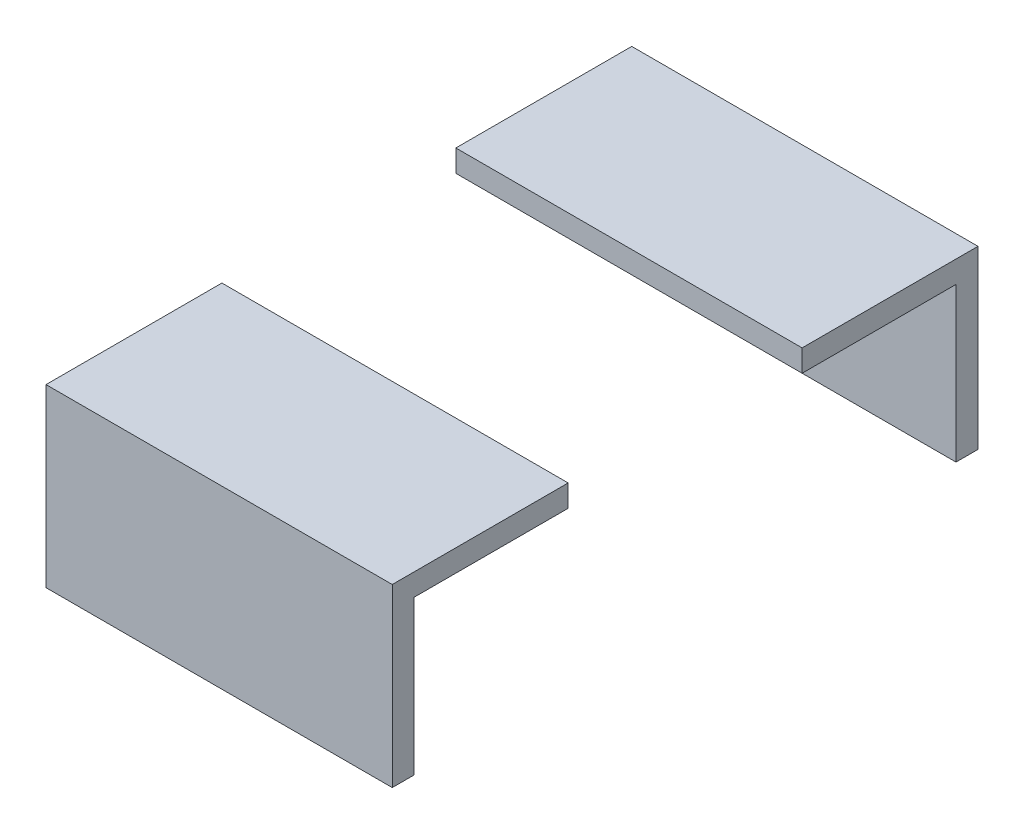
ISO-10303-21;
HEADER;
FILE_DESCRIPTION(('STEP AP214'),'2;1');
FILE_NAME('part.step','',(''),(''),'','','');
FILE_SCHEMA(('AUTOMOTIVE_DESIGN { 1 0 10303 214 1 1 1 1 }'));
ENDSEC;
DATA;
#1=APPLICATION_CONTEXT('core data for automotive mechanical design processes');
#2=APPLICATION_PROTOCOL_DEFINITION('international standard','automotive_design',2000,#1);
#3=PRODUCT_CONTEXT('',#1,'mechanical');
#4=PRODUCT('Part','Part','',(#3));
#5=PRODUCT_RELATED_PRODUCT_CATEGORY('part','',(#4));
#6=PRODUCT_DEFINITION_FORMATION('','',#4);
#7=PRODUCT_DEFINITION_CONTEXT('part definition',#1,'design');
#8=PRODUCT_DEFINITION('design','',#6,#7);
#9=PRODUCT_DEFINITION_SHAPE('','',#8);
#10=(LENGTH_UNIT() NAMED_UNIT(*) SI_UNIT(.MILLI.,.METRE.));
#11=(NAMED_UNIT(*) PLANE_ANGLE_UNIT() SI_UNIT($,.RADIAN.));
#12=(NAMED_UNIT(*) SI_UNIT($,.STERADIAN.) SOLID_ANGLE_UNIT());
#13=UNCERTAINTY_MEASURE_WITH_UNIT(LENGTH_MEASURE(1.E-05),#10,'distance_accuracy_value','');
#14=(GEOMETRIC_REPRESENTATION_CONTEXT(3) GLOBAL_UNCERTAINTY_ASSIGNED_CONTEXT((#13)) GLOBAL_UNIT_ASSIGNED_CONTEXT((#10,
#11,#12)) REPRESENTATION_CONTEXT('',''));
#15=CARTESIAN_POINT('',(0.,0.,0.));
#16=DIRECTION('',(0.,0.,1.));
#17=DIRECTION('',(1.,0.,0.));
#18=AXIS2_PLACEMENT_3D('',#15,#16,#17);
#19=CARTESIAN_POINT('',(12.5,5.3375,8.4455));
#20=DIRECTION('',(0.,-1.,0.));
#21=DIRECTION('',(0.,0.,-1.));
#22=AXIS2_PLACEMENT_3D('',#19,#20,#21);
#23=PLANE('',#22);
#24=DIRECTION('',(0.,0.,1.));
#25=VECTOR('',#24,1.);
#26=CARTESIAN_POINT('',(-12.5,5.3375,8.4455));
#27=LINE('',#26,#25);
#28=CARTESIAN_POINT('',(-12.5,5.3375,8.4455));
#29=VERTEX_POINT('',#28);
#30=CARTESIAN_POINT('',(-12.5,5.33749999999999,21.1455));
#31=VERTEX_POINT('',#30);
#32=EDGE_CURVE('E136',#29,#31,#27,.T.);
#33=ORIENTED_EDGE('',*,*,#32,.T.);
#34=DIRECTION('',(-1.,0.,0.));
#35=VECTOR('',#34,1.);
#36=CARTESIAN_POINT('',(12.5,5.33749999999999,21.1455));
#37=LINE('',#36,#35);
#38=CARTESIAN_POINT('',(12.5,5.33749999999999,21.1455));
#39=VERTEX_POINT('',#38);
#40=EDGE_CURVE('E12',#39,#31,#37,.T.);
#41=ORIENTED_EDGE('',*,*,#40,.F.);
#42=DIRECTION('',(0.,0.,1.));
#43=VECTOR('',#42,1.);
#44=CARTESIAN_POINT('',(12.5,5.3375,8.4455));
#45=LINE('',#44,#43);
#46=CARTESIAN_POINT('',(12.5,5.3375,8.4455));
#47=VERTEX_POINT('',#46);
#48=EDGE_CURVE('E146',#47,#39,#45,.T.);
#49=ORIENTED_EDGE('',*,*,#48,.F.);
#50=DIRECTION('',(-1.,0.,0.));
#51=VECTOR('',#50,1.);
#52=CARTESIAN_POINT('',(12.5,5.3375,8.4455));
#53=LINE('',#52,#51);
#54=EDGE_CURVE('E132',#47,#29,#53,.T.);
#55=ORIENTED_EDGE('',*,*,#54,.T.);
#56=EDGE_LOOP('',(#33,#41,#49,#55));
#57=FACE_BOUND('',#56,.T.);
#58=ADVANCED_FACE('F52',(#57),#23,.F.);
#59=CARTESIAN_POINT('',(12.5,5.33749999999999,21.1455));
#60=DIRECTION('',(0.,0.,-1.));
#61=DIRECTION('',(-1.,0.,0.));
#62=AXIS2_PLACEMENT_3D('',#59,#60,#61);
#63=PLANE('',#62);
#64=DIRECTION('',(0.,-1.,0.));
#65=VECTOR('',#64,1.);
#66=CARTESIAN_POINT('',(-12.5,5.33749999999999,21.1455));
#67=LINE('',#66,#65);
#68=CARTESIAN_POINT('',(-12.5,-7.36249999999998,21.1455));
#69=VERTEX_POINT('',#68);
#70=EDGE_CURVE('E139',#31,#69,#67,.T.);
#71=ORIENTED_EDGE('',*,*,#70,.T.);
#72=DIRECTION('',(-1.,0.,0.));
#73=VECTOR('',#72,1.);
#74=CARTESIAN_POINT('',(12.5,-7.36249999999998,21.1455));
#75=LINE('',#74,#73);
#76=CARTESIAN_POINT('',(12.5,-7.36249999999998,21.1455));
#77=VERTEX_POINT('',#76);
#78=EDGE_CURVE('E60',#77,#69,#75,.T.);
#79=ORIENTED_EDGE('',*,*,#78,.F.);
#80=DIRECTION('',(0.,-1.,0.));
#81=VECTOR('',#80,1.);
#82=CARTESIAN_POINT('',(12.5,5.33749999999999,21.1455));
#83=LINE('',#82,#81);
#84=EDGE_CURVE('E105',#39,#77,#83,.T.);
#85=ORIENTED_EDGE('',*,*,#84,.F.);
#86=ORIENTED_EDGE('',*,*,#40,.T.);
#87=EDGE_LOOP('',(#71,#79,#85,#86));
#88=FACE_BOUND('',#87,.T.);
#89=ADVANCED_FACE('F170',(#88),#63,.F.);
#90=CARTESIAN_POINT('',(12.5,-7.36249999999996,19.558));
#91=DIRECTION('',(0.,1.,0.));
#92=DIRECTION('',(0.,0.,1.));
#93=AXIS2_PLACEMENT_3D('',#90,#91,#92);
#94=PLANE('',#93);
#95=DIRECTION('',(0.,0.,-1.));
#96=VECTOR('',#95,1.);
#97=CARTESIAN_POINT('',(-12.5,-7.36249999999996,19.558));
#98=LINE('',#97,#96);
#99=CARTESIAN_POINT('',(-12.5,-7.36249999999996,19.558));
#100=VERTEX_POINT('',#99);
#101=EDGE_CURVE('E141',#69,#100,#98,.T.);
#102=ORIENTED_EDGE('',*,*,#101,.T.);
#103=DIRECTION('',(-1.,0.,0.));
#104=VECTOR('',#103,1.);
#105=CARTESIAN_POINT('',(12.5,-7.36249999999996,19.558));
#106=LINE('',#105,#104);
#107=CARTESIAN_POINT('',(12.5,-7.36249999999996,19.558));
#108=VERTEX_POINT('',#107);
#109=EDGE_CURVE('E127',#108,#100,#106,.T.);
#110=ORIENTED_EDGE('',*,*,#109,.F.);
#111=DIRECTION('',(0.,0.,-1.));
#112=VECTOR('',#111,1.);
#113=CARTESIAN_POINT('',(12.5,-7.36249999999996,19.558));
#114=LINE('',#113,#112);
#115=EDGE_CURVE('E118',#77,#108,#114,.T.);
#116=ORIENTED_EDGE('',*,*,#115,.F.);
#117=ORIENTED_EDGE('',*,*,#78,.T.);
#118=EDGE_LOOP('',(#102,#110,#116,#117));
#119=FACE_BOUND('',#118,.T.);
#120=ADVANCED_FACE('F152',(#119),#94,.F.);
#121=CARTESIAN_POINT('',(12.5,3.75,19.558));
#122=DIRECTION('',(0.,0.,1.));
#123=DIRECTION('',(1.,0.,0.));
#124=AXIS2_PLACEMENT_3D('',#121,#122,#123);
#125=PLANE('',#124);
#126=DIRECTION('',(0.,1.,0.));
#127=VECTOR('',#126,1.);
#128=CARTESIAN_POINT('',(-12.5,3.75,19.558));
#129=LINE('',#128,#127);
#130=CARTESIAN_POINT('',(-12.5,3.75,19.558));
#131=VERTEX_POINT('',#130);
#132=EDGE_CURVE('E126',#100,#131,#129,.T.);
#133=ORIENTED_EDGE('',*,*,#132,.T.);
#134=DIRECTION('',(-1.,0.,0.));
#135=VECTOR('',#134,1.);
#136=CARTESIAN_POINT('',(12.5,3.75,19.558));
#137=LINE('',#136,#135);
#138=CARTESIAN_POINT('',(12.5,3.75,19.558));
#139=VERTEX_POINT('',#138);
#140=EDGE_CURVE('E123',#139,#131,#137,.T.);
#141=ORIENTED_EDGE('',*,*,#140,.F.);
#142=DIRECTION('',(0.,1.,0.));
#143=VECTOR('',#142,1.);
#144=CARTESIAN_POINT('',(12.5,3.75,19.558));
#145=LINE('',#144,#143);
#146=EDGE_CURVE('E112',#108,#139,#145,.T.);
#147=ORIENTED_EDGE('',*,*,#146,.F.);
#148=ORIENTED_EDGE('',*,*,#109,.T.);
#149=EDGE_LOOP('',(#133,#141,#147,#148));
#150=FACE_BOUND('',#149,.T.);
#151=ADVANCED_FACE('F124',(#150),#125,.F.);
#152=CARTESIAN_POINT('',(12.5,3.75,8.4455));
#153=DIRECTION('',(0.,1.,0.));
#154=DIRECTION('',(0.,0.,1.));
#155=AXIS2_PLACEMENT_3D('',#152,#153,#154);
#156=PLANE('',#155);
#157=DIRECTION('',(0.,0.,-1.));
#158=VECTOR('',#157,1.);
#159=CARTESIAN_POINT('',(-12.5,3.75,8.4455));
#160=LINE('',#159,#158);
#161=CARTESIAN_POINT('',(-12.5,3.75,8.4455));
#162=VERTEX_POINT('',#161);
#163=EDGE_CURVE('E91',#131,#162,#160,.T.);
#164=ORIENTED_EDGE('',*,*,#163,.T.);
#165=DIRECTION('',(-1.,0.,0.));
#166=VECTOR('',#165,1.);
#167=CARTESIAN_POINT('',(12.5,3.75,8.4455));
#168=LINE('',#167,#166);
#169=CARTESIAN_POINT('',(12.5,3.75,8.4455));
#170=VERTEX_POINT('',#169);
#171=EDGE_CURVE('E128',#170,#162,#168,.T.);
#172=ORIENTED_EDGE('',*,*,#171,.F.);
#173=DIRECTION('',(0.,0.,-1.));
#174=VECTOR('',#173,1.);
#175=CARTESIAN_POINT('',(12.5,3.75,8.4455));
#176=LINE('',#175,#174);
#177=EDGE_CURVE('E116',#139,#170,#176,.T.);
#178=ORIENTED_EDGE('',*,*,#177,.F.);
#179=ORIENTED_EDGE('',*,*,#140,.T.);
#180=EDGE_LOOP('',(#164,#172,#178,#179));
#181=FACE_BOUND('',#180,.T.);
#182=ADVANCED_FACE('F130',(#181),#156,.F.);
#183=CARTESIAN_POINT('',(12.5,3.75,8.4455));
#184=DIRECTION('',(0.,0.,1.));
#185=DIRECTION('',(0.,-1.,0.));
#186=AXIS2_PLACEMENT_3D('',#183,#184,#185);
#187=PLANE('',#186);
#188=DIRECTION('',(0.,1.,0.));
#189=VECTOR('',#188,1.);
#190=CARTESIAN_POINT('',(-12.5,3.75,8.4455));
#191=LINE('',#190,#189);
#192=EDGE_CURVE('E97',#162,#29,#191,.T.);
#193=ORIENTED_EDGE('',*,*,#192,.T.);
#194=ORIENTED_EDGE('',*,*,#54,.F.);
#195=DIRECTION('',(0.,1.,0.));
#196=VECTOR('',#195,1.);
#197=CARTESIAN_POINT('',(12.5,3.75,8.4455));
#198=LINE('',#197,#196);
#199=EDGE_CURVE('E68',#170,#47,#198,.T.);
#200=ORIENTED_EDGE('',*,*,#199,.F.);
#201=ORIENTED_EDGE('',*,*,#171,.T.);
#202=EDGE_LOOP('',(#193,#194,#200,#201));
#203=FACE_BOUND('',#202,.T.);
#204=ADVANCED_FACE('F159',(#203),#187,.F.);
#205=CARTESIAN_POINT('',(12.5,0.,0.));
#206=DIRECTION('',(1.,0.,0.));
#207=DIRECTION('',(0.,0.,-1.));
#208=AXIS2_PLACEMENT_3D('',#205,#206,#207);
#209=PLANE('',#208);
#210=ORIENTED_EDGE('',*,*,#48,.T.);
#211=ORIENTED_EDGE('',*,*,#84,.T.);
#212=ORIENTED_EDGE('',*,*,#115,.T.);
#213=ORIENTED_EDGE('',*,*,#146,.T.);
#214=ORIENTED_EDGE('',*,*,#177,.T.);
#215=ORIENTED_EDGE('',*,*,#199,.T.);
#216=EDGE_LOOP('',(#210,#211,#212,#213,#214,#215));
#217=FACE_BOUND('',#216,.T.);
#218=ADVANCED_FACE('F114',(#217),#209,.T.);
#219=CARTESIAN_POINT('',(-12.5,0.,0.));
#220=DIRECTION('',(1.,0.,0.));
#221=DIRECTION('',(0.,0.,-1.));
#222=AXIS2_PLACEMENT_3D('',#219,#220,#221);
#223=PLANE('',#222);
#224=ORIENTED_EDGE('',*,*,#32,.F.);
#225=ORIENTED_EDGE('',*,*,#192,.F.);
#226=ORIENTED_EDGE('',*,*,#163,.F.);
#227=ORIENTED_EDGE('',*,*,#132,.F.);
#228=ORIENTED_EDGE('',*,*,#101,.F.);
#229=ORIENTED_EDGE('',*,*,#70,.F.);
#230=EDGE_LOOP('',(#224,#225,#226,#227,#228,#229));
#231=FACE_BOUND('',#230,.T.);
#232=ADVANCED_FACE('F155',(#231),#223,.F.);
#233=CLOSED_SHELL('',(#58,#89,#120,#151,#182,#204,#218,#232));
#234=MANIFOLD_SOLID_BREP('B2',#233);
#235=CARTESIAN_POINT('',(12.5,3.75,-8.4455));
#236=DIRECTION('',(0.,0.,-1.));
#237=DIRECTION('',(0.,1.,0.));
#238=AXIS2_PLACEMENT_3D('',#235,#236,#237);
#239=PLANE('',#238);
#240=DIRECTION('',(0.,-1.,0.));
#241=VECTOR('',#240,1.);
#242=CARTESIAN_POINT('',(-12.5,3.75,-8.4455));
#243=LINE('',#242,#241);
#244=CARTESIAN_POINT('',(-12.5,5.3375,-8.4455));
#245=VERTEX_POINT('',#244);
#246=CARTESIAN_POINT('',(-12.5,3.75,-8.4455));
#247=VERTEX_POINT('',#246);
#248=EDGE_CURVE('E330',#245,#247,#243,.T.);
#249=ORIENTED_EDGE('',*,*,#248,.T.);
#250=DIRECTION('',(-1.,0.,0.));
#251=VECTOR('',#250,1.);
#252=CARTESIAN_POINT('',(12.5,3.75,-8.4455));
#253=LINE('',#252,#251);
#254=CARTESIAN_POINT('',(12.5,3.75,-8.4455));
#255=VERTEX_POINT('',#254);
#256=EDGE_CURVE('E50',#255,#247,#253,.T.);
#257=ORIENTED_EDGE('',*,*,#256,.F.);
#258=DIRECTION('',(0.,-1.,0.));
#259=VECTOR('',#258,1.);
#260=CARTESIAN_POINT('',(12.5,3.75,-8.4455));
#261=LINE('',#260,#259);
#262=CARTESIAN_POINT('',(12.5,5.3375,-8.4455));
#263=VERTEX_POINT('',#262);
#264=EDGE_CURVE('E346',#263,#255,#261,.T.);
#265=ORIENTED_EDGE('',*,*,#264,.F.);
#266=DIRECTION('',(-1.,0.,0.));
#267=VECTOR('',#266,1.);
#268=CARTESIAN_POINT('',(12.5,5.3375,-8.4455));
#269=LINE('',#268,#267);
#270=EDGE_CURVE('E326',#263,#245,#269,.T.);
#271=ORIENTED_EDGE('',*,*,#270,.T.);
#272=EDGE_LOOP('',(#249,#257,#265,#271));
#273=FACE_BOUND('',#272,.T.);
#274=ADVANCED_FACE('F227',(#273),#239,.F.);
#275=CARTESIAN_POINT('',(12.5,3.75,-8.4455));
#276=DIRECTION('',(0.,1.,0.));
#277=DIRECTION('',(0.,0.,1.));
#278=AXIS2_PLACEMENT_3D('',#275,#276,#277);
#279=PLANE('',#278);
#280=DIRECTION('',(0.,0.,-1.));
#281=VECTOR('',#280,1.);
#282=CARTESIAN_POINT('',(-12.5,3.75,-8.4455));
#283=LINE('',#282,#281);
#284=CARTESIAN_POINT('',(-12.5,3.75,-19.558));
#285=VERTEX_POINT('',#284);
#286=EDGE_CURVE('E334',#247,#285,#283,.T.);
#287=ORIENTED_EDGE('',*,*,#286,.T.);
#288=DIRECTION('',(-1.,0.,0.));
#289=VECTOR('',#288,1.);
#290=CARTESIAN_POINT('',(12.5,3.75,-19.558));
#291=LINE('',#290,#289);
#292=CARTESIAN_POINT('',(12.5,3.75,-19.558));
#293=VERTEX_POINT('',#292);
#294=EDGE_CURVE('E236',#293,#285,#291,.T.);
#295=ORIENTED_EDGE('',*,*,#294,.F.);
#296=DIRECTION('',(0.,0.,-1.));
#297=VECTOR('',#296,1.);
#298=CARTESIAN_POINT('',(12.5,3.75,-8.4455));
#299=LINE('',#298,#297);
#300=EDGE_CURVE('E292',#255,#293,#299,.T.);
#301=ORIENTED_EDGE('',*,*,#300,.F.);
#302=ORIENTED_EDGE('',*,*,#256,.T.);
#303=EDGE_LOOP('',(#287,#295,#301,#302));
#304=FACE_BOUND('',#303,.T.);
#305=ADVANCED_FACE('F373',(#304),#279,.F.);
#306=CARTESIAN_POINT('',(12.5,3.75,-19.558));
#307=DIRECTION('',(0.,0.,-1.));
#308=DIRECTION('',(-1.,0.,0.));
#309=AXIS2_PLACEMENT_3D('',#306,#307,#308);
#310=PLANE('',#309);
#311=DIRECTION('',(0.,-1.,0.));
#312=VECTOR('',#311,1.);
#313=CARTESIAN_POINT('',(-12.5,3.75,-19.558));
#314=LINE('',#313,#312);
#315=CARTESIAN_POINT('',(-12.5,-7.36249999999995,-19.558));
#316=VERTEX_POINT('',#315);
#317=EDGE_CURVE('E337',#285,#316,#314,.T.);
#318=ORIENTED_EDGE('',*,*,#317,.T.);
#319=DIRECTION('',(-1.,0.,0.));
#320=VECTOR('',#319,1.);
#321=CARTESIAN_POINT('',(12.5,-7.36249999999995,-19.558));
#322=LINE('',#321,#320);
#323=CARTESIAN_POINT('',(12.5,-7.36249999999995,-19.558));
#324=VERTEX_POINT('',#323);
#325=EDGE_CURVE('E317',#324,#316,#322,.T.);
#326=ORIENTED_EDGE('',*,*,#325,.F.);
#327=DIRECTION('',(0.,-1.,0.));
#328=VECTOR('',#327,1.);
#329=CARTESIAN_POINT('',(12.5,3.75,-19.558));
#330=LINE('',#329,#328);
#331=EDGE_CURVE('E306',#293,#324,#330,.T.);
#332=ORIENTED_EDGE('',*,*,#331,.F.);
#333=ORIENTED_EDGE('',*,*,#294,.T.);
#334=EDGE_LOOP('',(#318,#326,#332,#333));
#335=FACE_BOUND('',#334,.T.);
#336=ADVANCED_FACE('F355',(#335),#310,.F.);
#337=CARTESIAN_POINT('',(12.5,-7.36249999999995,-19.558));
#338=DIRECTION('',(0.,1.,0.));
#339=DIRECTION('',(0.,0.,1.));
#340=AXIS2_PLACEMENT_3D('',#337,#338,#339);
#341=PLANE('',#340);
#342=DIRECTION('',(0.,0.,-1.));
#343=VECTOR('',#342,1.);
#344=CARTESIAN_POINT('',(-12.5,-7.36249999999995,-19.558));
#345=LINE('',#344,#343);
#346=CARTESIAN_POINT('',(-12.5,-7.36249999999998,-21.1455));
#347=VERTEX_POINT('',#346);
#348=EDGE_CURVE('E315',#316,#347,#345,.T.);
#349=ORIENTED_EDGE('',*,*,#348,.T.);
#350=DIRECTION('',(-1.,0.,0.));
#351=VECTOR('',#350,1.);
#352=CARTESIAN_POINT('',(12.5,-7.36249999999998,-21.1455));
#353=LINE('',#352,#351);
#354=CARTESIAN_POINT('',(12.5,-7.36249999999998,-21.1455));
#355=VERTEX_POINT('',#354);
#356=EDGE_CURVE('E312',#355,#347,#353,.T.);
#357=ORIENTED_EDGE('',*,*,#356,.F.);
#358=DIRECTION('',(0.,0.,-1.));
#359=VECTOR('',#358,1.);
#360=CARTESIAN_POINT('',(12.5,-7.36249999999995,-19.558));
#361=LINE('',#360,#359);
#362=EDGE_CURVE('E300',#324,#355,#361,.T.);
#363=ORIENTED_EDGE('',*,*,#362,.F.);
#364=ORIENTED_EDGE('',*,*,#325,.T.);
#365=EDGE_LOOP('',(#349,#357,#363,#364));
#366=FACE_BOUND('',#365,.T.);
#367=ADVANCED_FACE('F313',(#366),#341,.F.);
#368=CARTESIAN_POINT('',(12.5,5.3375,-21.1455));
#369=DIRECTION('',(0.,0.,1.));
#370=DIRECTION('',(1.,0.,0.));
#371=AXIS2_PLACEMENT_3D('',#368,#369,#370);
#372=PLANE('',#371);
#373=DIRECTION('',(0.,1.,0.));
#374=VECTOR('',#373,1.);
#375=CARTESIAN_POINT('',(-12.5,5.3375,-21.1455));
#376=LINE('',#375,#374);
#377=CARTESIAN_POINT('',(-12.5,5.3375,-21.1455));
#378=VERTEX_POINT('',#377);
#379=EDGE_CURVE('E275',#347,#378,#376,.T.);
#380=ORIENTED_EDGE('',*,*,#379,.T.);
#381=DIRECTION('',(-1.,0.,0.));
#382=VECTOR('',#381,1.);
#383=CARTESIAN_POINT('',(12.5,5.3375,-21.1455));
#384=LINE('',#383,#382);
#385=CARTESIAN_POINT('',(12.5,5.3375,-21.1455));
#386=VERTEX_POINT('',#385);
#387=EDGE_CURVE('E318',#386,#378,#384,.T.);
#388=ORIENTED_EDGE('',*,*,#387,.F.);
#389=DIRECTION('',(0.,1.,0.));
#390=VECTOR('',#389,1.);
#391=CARTESIAN_POINT('',(12.5,5.3375,-21.1455));
#392=LINE('',#391,#390);
#393=EDGE_CURVE('E304',#355,#386,#392,.T.);
#394=ORIENTED_EDGE('',*,*,#393,.F.);
#395=ORIENTED_EDGE('',*,*,#356,.T.);
#396=EDGE_LOOP('',(#380,#388,#394,#395));
#397=FACE_BOUND('',#396,.T.);
#398=ADVANCED_FACE('F320',(#397),#372,.F.);
#399=CARTESIAN_POINT('',(12.5,5.3375,-8.4455));
#400=DIRECTION('',(0.,-1.,0.));
#401=DIRECTION('',(0.,0.,-1.));
#402=AXIS2_PLACEMENT_3D('',#399,#400,#401);
#403=PLANE('',#402);
#404=DIRECTION('',(0.,0.,1.));
#405=VECTOR('',#404,1.);
#406=CARTESIAN_POINT('',(-12.5,5.3375,-8.4455));
#407=LINE('',#406,#405);
#408=EDGE_CURVE('E282',#378,#245,#407,.T.);
#409=ORIENTED_EDGE('',*,*,#408,.T.);
#410=ORIENTED_EDGE('',*,*,#270,.F.);
#411=DIRECTION('',(0.,0.,1.));
#412=VECTOR('',#411,1.);
#413=CARTESIAN_POINT('',(12.5,5.3375,-8.4455));
#414=LINE('',#413,#412);
#415=EDGE_CURVE('E247',#386,#263,#414,.T.);
#416=ORIENTED_EDGE('',*,*,#415,.F.);
#417=ORIENTED_EDGE('',*,*,#387,.T.);
#418=EDGE_LOOP('',(#409,#410,#416,#417));
#419=FACE_BOUND('',#418,.T.);
#420=ADVANCED_FACE('F362',(#419),#403,.F.);
#421=CARTESIAN_POINT('',(12.5,0.,0.));
#422=DIRECTION('',(-1.,0.,0.));
#423=DIRECTION('',(0.,0.,1.));
#424=AXIS2_PLACEMENT_3D('',#421,#422,#423);
#425=PLANE('',#424);
#426=ORIENTED_EDGE('',*,*,#264,.T.);
#427=ORIENTED_EDGE('',*,*,#300,.T.);
#428=ORIENTED_EDGE('',*,*,#331,.T.);
#429=ORIENTED_EDGE('',*,*,#362,.T.);
#430=ORIENTED_EDGE('',*,*,#393,.T.);
#431=ORIENTED_EDGE('',*,*,#415,.T.);
#432=EDGE_LOOP('',(#426,#427,#428,#429,#430,#431));
#433=FACE_BOUND('',#432,.T.);
#434=ADVANCED_FACE('F302',(#433),#425,.F.);
#435=CARTESIAN_POINT('',(-12.5,0.,0.));
#436=DIRECTION('',(-1.,0.,0.));
#437=DIRECTION('',(0.,0.,1.));
#438=AXIS2_PLACEMENT_3D('',#435,#436,#437);
#439=PLANE('',#438);
#440=ORIENTED_EDGE('',*,*,#248,.F.);
#441=ORIENTED_EDGE('',*,*,#408,.F.);
#442=ORIENTED_EDGE('',*,*,#379,.F.);
#443=ORIENTED_EDGE('',*,*,#348,.F.);
#444=ORIENTED_EDGE('',*,*,#317,.F.);
#445=ORIENTED_EDGE('',*,*,#286,.F.);
#446=EDGE_LOOP('',(#440,#441,#442,#443,#444,#445));
#447=FACE_BOUND('',#446,.T.);
#448=ADVANCED_FACE('F358',(#447),#439,.T.);
#449=CLOSED_SHELL('',(#274,#305,#336,#367,#398,#420,#434,#448));
#450=MANIFOLD_SOLID_BREP('B6',#449);
#451=ADVANCED_BREP_SHAPE_REPRESENTATION('',(#18,#234,#450),#14);
#452=SHAPE_DEFINITION_REPRESENTATION(#9,#451);
ENDSEC;
END-ISO-10303-21;
